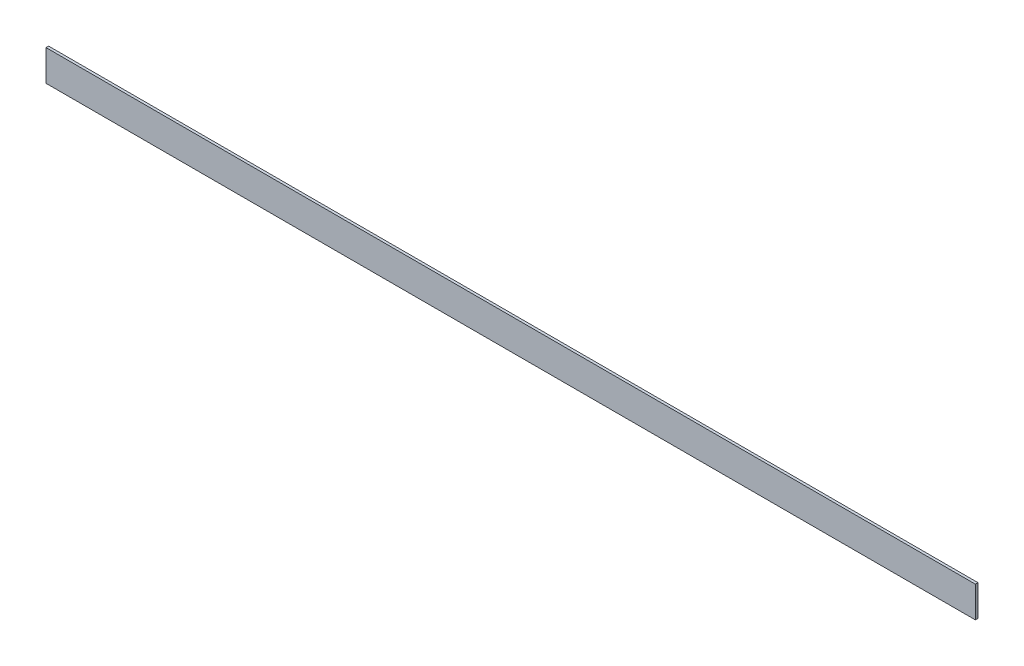
ISO-10303-21;
HEADER;
FILE_DESCRIPTION(('STEP AP214'),'2;1');
FILE_NAME('part.step','',(''),(''),'','','');
FILE_SCHEMA(('AUTOMOTIVE_DESIGN { 1 0 10303 214 1 1 1 1 }'));
ENDSEC;
DATA;
#1=APPLICATION_CONTEXT('core data for automotive mechanical design processes');
#2=APPLICATION_PROTOCOL_DEFINITION('international standard','automotive_design',2000,#1);
#3=PRODUCT_CONTEXT('',#1,'mechanical');
#4=PRODUCT('Part','Part','',(#3));
#5=PRODUCT_RELATED_PRODUCT_CATEGORY('part','',(#4));
#6=PRODUCT_DEFINITION_FORMATION('','',#4);
#7=PRODUCT_DEFINITION_CONTEXT('part definition',#1,'design');
#8=PRODUCT_DEFINITION('design','',#6,#7);
#9=PRODUCT_DEFINITION_SHAPE('','',#8);
#10=(LENGTH_UNIT() NAMED_UNIT(*) SI_UNIT(.MILLI.,.METRE.));
#11=(NAMED_UNIT(*) PLANE_ANGLE_UNIT() SI_UNIT($,.RADIAN.));
#12=(NAMED_UNIT(*) SI_UNIT($,.STERADIAN.) SOLID_ANGLE_UNIT());
#13=UNCERTAINTY_MEASURE_WITH_UNIT(LENGTH_MEASURE(1.E-05),#10,'distance_accuracy_value','');
#14=(GEOMETRIC_REPRESENTATION_CONTEXT(3) GLOBAL_UNCERTAINTY_ASSIGNED_CONTEXT((#13)) GLOBAL_UNIT_ASSIGNED_CONTEXT((#10,
#11,#12)) REPRESENTATION_CONTEXT('',''));
#15=CARTESIAN_POINT('',(0.,0.,0.));
#16=DIRECTION('',(0.,0.,1.));
#17=DIRECTION('',(1.,0.,0.));
#18=AXIS2_PLACEMENT_3D('',#15,#16,#17);
#19=CARTESIAN_POINT('',(2286.,-38.1,-3.175));
#20=DIRECTION('',(0.,0.,1.));
#21=DIRECTION('',(1.,0.,0.));
#22=AXIS2_PLACEMENT_3D('',#19,#20,#21);
#23=PLANE('',#22);
#24=DIRECTION('',(0.,1.,0.));
#25=VECTOR('',#24,1.);
#26=CARTESIAN_POINT('',(0.,-38.1,-3.175));
#27=LINE('',#26,#25);
#28=CARTESIAN_POINT('',(0.,-38.1,-3.175));
#29=VERTEX_POINT('',#28);
#30=CARTESIAN_POINT('',(0.,38.1,-3.175));
#31=VERTEX_POINT('',#30);
#32=EDGE_CURVE('E98',#29,#31,#27,.T.);
#33=ORIENTED_EDGE('',*,*,#32,.T.);
#34=DIRECTION('',(-1.,0.,0.));
#35=VECTOR('',#34,1.);
#36=CARTESIAN_POINT('',(2286.,38.1,-3.175));
#37=LINE('',#36,#35);
#38=CARTESIAN_POINT('',(2286.,38.1,-3.175));
#39=VERTEX_POINT('',#38);
#40=EDGE_CURVE('E11',#39,#31,#37,.T.);
#41=ORIENTED_EDGE('',*,*,#40,.F.);
#42=DIRECTION('',(0.,1.,0.));
#43=VECTOR('',#42,1.);
#44=CARTESIAN_POINT('',(2286.,-38.1,-3.175));
#45=LINE('',#44,#43);
#46=CARTESIAN_POINT('',(2286.,-38.1,-3.175));
#47=VERTEX_POINT('',#46);
#48=EDGE_CURVE('E86',#47,#39,#45,.T.);
#49=ORIENTED_EDGE('',*,*,#48,.F.);
#50=DIRECTION('',(-1.,0.,0.));
#51=VECTOR('',#50,1.);
#52=CARTESIAN_POINT('',(2286.,-38.1,-3.175));
#53=LINE('',#52,#51);
#54=EDGE_CURVE('E94',#47,#29,#53,.T.);
#55=ORIENTED_EDGE('',*,*,#54,.T.);
#56=EDGE_LOOP('',(#33,#41,#49,#55));
#57=FACE_BOUND('',#56,.T.);
#58=ADVANCED_FACE('F35',(#57),#23,.F.);
#59=CARTESIAN_POINT('',(2286.,38.1,3.175));
#60=DIRECTION('',(0.,-1.,0.));
#61=DIRECTION('',(0.,0.,-1.));
#62=AXIS2_PLACEMENT_3D('',#59,#60,#61);
#63=PLANE('',#62);
#64=DIRECTION('',(0.,0.,1.));
#65=VECTOR('',#64,1.);
#66=CARTESIAN_POINT('',(0.,38.1,3.175));
#67=LINE('',#66,#65);
#68=CARTESIAN_POINT('',(0.,38.1,3.175));
#69=VERTEX_POINT('',#68);
#70=EDGE_CURVE('E90',#31,#69,#67,.T.);
#71=ORIENTED_EDGE('',*,*,#70,.T.);
#72=DIRECTION('',(-1.,0.,0.));
#73=VECTOR('',#72,1.);
#74=CARTESIAN_POINT('',(2286.,38.1,3.175));
#75=LINE('',#74,#73);
#76=CARTESIAN_POINT('',(2286.,38.1,3.175));
#77=VERTEX_POINT('',#76);
#78=EDGE_CURVE('E43',#77,#69,#75,.T.);
#79=ORIENTED_EDGE('',*,*,#78,.F.);
#80=DIRECTION('',(0.,0.,1.));
#81=VECTOR('',#80,1.);
#82=CARTESIAN_POINT('',(2286.,38.1,3.175));
#83=LINE('',#82,#81);
#84=EDGE_CURVE('E81',#39,#77,#83,.T.);
#85=ORIENTED_EDGE('',*,*,#84,.F.);
#86=ORIENTED_EDGE('',*,*,#40,.T.);
#87=EDGE_LOOP('',(#71,#79,#85,#86));
#88=FACE_BOUND('',#87,.T.);
#89=ADVANCED_FACE('F89',(#88),#63,.F.);
#90=CARTESIAN_POINT('',(2286.,-38.1,3.175));
#91=DIRECTION('',(0.,0.,-1.));
#92=DIRECTION('',(-1.,0.,0.));
#93=AXIS2_PLACEMENT_3D('',#90,#91,#92);
#94=PLANE('',#93);
#95=DIRECTION('',(0.,-1.,0.));
#96=VECTOR('',#95,1.);
#97=CARTESIAN_POINT('',(0.,-38.1,3.175));
#98=LINE('',#97,#96);
#99=CARTESIAN_POINT('',(0.,-38.1,3.175));
#100=VERTEX_POINT('',#99);
#101=EDGE_CURVE('E68',#69,#100,#98,.T.);
#102=ORIENTED_EDGE('',*,*,#101,.T.);
#103=DIRECTION('',(-1.,0.,0.));
#104=VECTOR('',#103,1.);
#105=CARTESIAN_POINT('',(2286.,-38.1,3.175));
#106=LINE('',#105,#104);
#107=CARTESIAN_POINT('',(2286.,-38.1,3.175));
#108=VERTEX_POINT('',#107);
#109=EDGE_CURVE('E91',#108,#100,#106,.T.);
#110=ORIENTED_EDGE('',*,*,#109,.F.);
#111=DIRECTION('',(0.,-1.,0.));
#112=VECTOR('',#111,1.);
#113=CARTESIAN_POINT('',(2286.,-38.1,3.175));
#114=LINE('',#113,#112);
#115=EDGE_CURVE('E84',#77,#108,#114,.T.);
#116=ORIENTED_EDGE('',*,*,#115,.F.);
#117=ORIENTED_EDGE('',*,*,#78,.T.);
#118=EDGE_LOOP('',(#102,#110,#116,#117));
#119=FACE_BOUND('',#118,.T.);
#120=ADVANCED_FACE('F92',(#119),#94,.F.);
#121=CARTESIAN_POINT('',(2286.,-38.1,3.175));
#122=DIRECTION('',(0.,1.,0.));
#123=DIRECTION('',(0.,0.,1.));
#124=AXIS2_PLACEMENT_3D('',#121,#122,#123);
#125=PLANE('',#124);
#126=DIRECTION('',(0.,0.,-1.));
#127=VECTOR('',#126,1.);
#128=CARTESIAN_POINT('',(0.,-38.1,3.175));
#129=LINE('',#128,#127);
#130=EDGE_CURVE('E74',#100,#29,#129,.T.);
#131=ORIENTED_EDGE('',*,*,#130,.T.);
#132=ORIENTED_EDGE('',*,*,#54,.F.);
#133=DIRECTION('',(0.,0.,-1.));
#134=VECTOR('',#133,1.);
#135=CARTESIAN_POINT('',(2286.,-38.1,3.175));
#136=LINE('',#135,#134);
#137=EDGE_CURVE('E51',#108,#47,#136,.T.);
#138=ORIENTED_EDGE('',*,*,#137,.F.);
#139=ORIENTED_EDGE('',*,*,#109,.T.);
#140=EDGE_LOOP('',(#131,#132,#138,#139));
#141=FACE_BOUND('',#140,.T.);
#142=ADVANCED_FACE('F105',(#141),#125,.F.);
#143=CARTESIAN_POINT('',(2286.,0.,0.));
#144=DIRECTION('',(-1.,0.,0.));
#145=DIRECTION('',(0.,0.,1.));
#146=AXIS2_PLACEMENT_3D('',#143,#144,#145);
#147=PLANE('',#146);
#148=ORIENTED_EDGE('',*,*,#48,.T.);
#149=ORIENTED_EDGE('',*,*,#84,.T.);
#150=ORIENTED_EDGE('',*,*,#115,.T.);
#151=ORIENTED_EDGE('',*,*,#137,.T.);
#152=EDGE_LOOP('',(#148,#149,#150,#151));
#153=FACE_BOUND('',#152,.T.);
#154=ADVANCED_FACE('F82',(#153),#147,.F.);
#155=CARTESIAN_POINT('',(0.,0.,0.));
#156=DIRECTION('',(-1.,0.,0.));
#157=DIRECTION('',(0.,0.,1.));
#158=AXIS2_PLACEMENT_3D('',#155,#156,#157);
#159=PLANE('',#158);
#160=ORIENTED_EDGE('',*,*,#32,.F.);
#161=ORIENTED_EDGE('',*,*,#130,.F.);
#162=ORIENTED_EDGE('',*,*,#101,.F.);
#163=ORIENTED_EDGE('',*,*,#70,.F.);
#164=EDGE_LOOP('',(#160,#161,#162,#163));
#165=FACE_BOUND('',#164,.T.);
#166=ADVANCED_FACE('F108',(#165),#159,.T.);
#167=CLOSED_SHELL('',(#58,#89,#120,#142,#154,#166));
#168=MANIFOLD_SOLID_BREP('B2',#167);
#169=ADVANCED_BREP_SHAPE_REPRESENTATION('',(#18,#168),#14);
#170=SHAPE_DEFINITION_REPRESENTATION(#9,#169);
ENDSEC;
END-ISO-10303-21;
